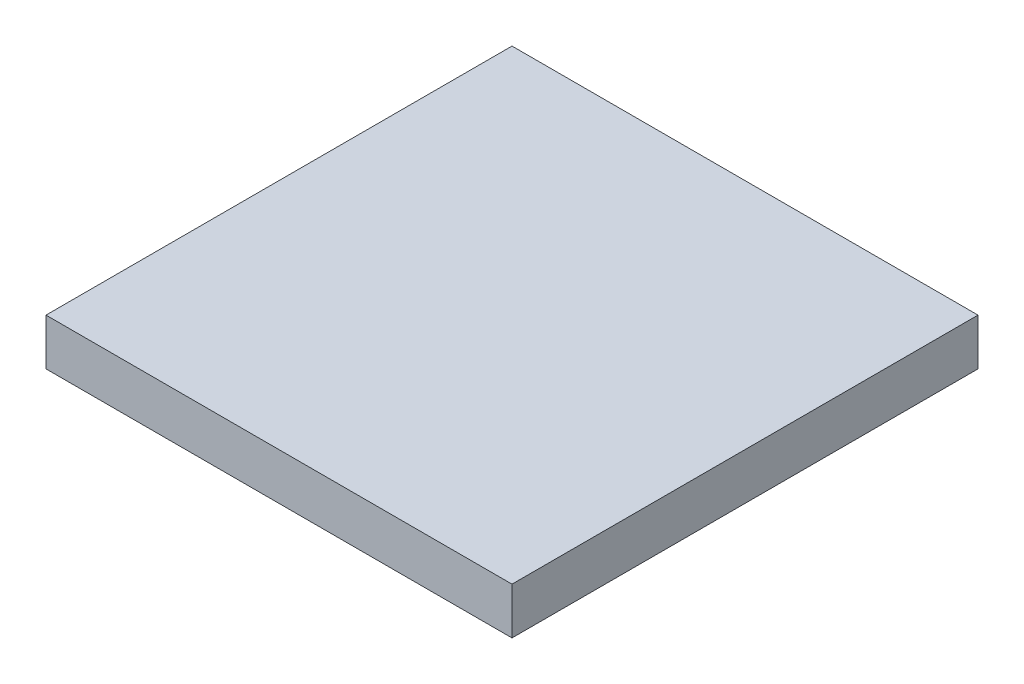
ISO-10303-21;
HEADER;
FILE_DESCRIPTION(('STEP AP214'),'2;1');
FILE_NAME('part.step','',(''),(''),'','','');
FILE_SCHEMA(('AUTOMOTIVE_DESIGN { 1 0 10303 214 1 1 1 1 }'));
ENDSEC;
DATA;
#1=APPLICATION_CONTEXT('core data for automotive mechanical design processes');
#2=APPLICATION_PROTOCOL_DEFINITION('international standard','automotive_design',2000,#1);
#3=PRODUCT_CONTEXT('',#1,'mechanical');
#4=PRODUCT('Part','Part','',(#3));
#5=PRODUCT_RELATED_PRODUCT_CATEGORY('part','',(#4));
#6=PRODUCT_DEFINITION_FORMATION('','',#4);
#7=PRODUCT_DEFINITION_CONTEXT('part definition',#1,'design');
#8=PRODUCT_DEFINITION('design','',#6,#7);
#9=PRODUCT_DEFINITION_SHAPE('','',#8);
#10=(LENGTH_UNIT() NAMED_UNIT(*) SI_UNIT(.MILLI.,.METRE.));
#11=(NAMED_UNIT(*) PLANE_ANGLE_UNIT() SI_UNIT($,.RADIAN.));
#12=(NAMED_UNIT(*) SI_UNIT($,.STERADIAN.) SOLID_ANGLE_UNIT());
#13=UNCERTAINTY_MEASURE_WITH_UNIT(LENGTH_MEASURE(1.E-05),#10,'distance_accuracy_value','');
#14=(GEOMETRIC_REPRESENTATION_CONTEXT(3) GLOBAL_UNCERTAINTY_ASSIGNED_CONTEXT((#13)) GLOBAL_UNIT_ASSIGNED_CONTEXT((#10,
#11,#12)) REPRESENTATION_CONTEXT('',''));
#15=CARTESIAN_POINT('',(0.,0.,0.));
#16=DIRECTION('',(0.,0.,1.));
#17=DIRECTION('',(1.,0.,0.));
#18=AXIS2_PLACEMENT_3D('',#15,#16,#17);
#19=CARTESIAN_POINT('',(150.,30.,150.));
#20=DIRECTION('',(-1.,0.,0.));
#21=DIRECTION('',(0.,0.,1.));
#22=AXIS2_PLACEMENT_3D('',#19,#20,#21);
#23=PLANE('',#22);
#24=DIRECTION('',(0.,0.,-1.));
#25=VECTOR('',#24,1.);
#26=CARTESIAN_POINT('',(150.,0.,150.));
#27=LINE('',#26,#25);
#28=CARTESIAN_POINT('',(150.,0.,150.));
#29=VERTEX_POINT('',#28);
#30=CARTESIAN_POINT('',(150.,0.,-150.));
#31=VERTEX_POINT('',#30);
#32=EDGE_CURVE('E96',#29,#31,#27,.T.);
#33=ORIENTED_EDGE('',*,*,#32,.T.);
#34=DIRECTION('',(0.,-1.,0.));
#35=VECTOR('',#34,1.);
#36=CARTESIAN_POINT('',(150.,30.,-150.));
#37=LINE('',#36,#35);
#38=CARTESIAN_POINT('',(150.,30.,-150.));
#39=VERTEX_POINT('',#38);
#40=EDGE_CURVE('E11',#39,#31,#37,.T.);
#41=ORIENTED_EDGE('',*,*,#40,.F.);
#42=DIRECTION('',(0.,0.,-1.));
#43=VECTOR('',#42,1.);
#44=CARTESIAN_POINT('',(150.,30.,150.));
#45=LINE('',#44,#43);
#46=CARTESIAN_POINT('',(150.,30.,150.));
#47=VERTEX_POINT('',#46);
#48=EDGE_CURVE('E84',#47,#39,#45,.T.);
#49=ORIENTED_EDGE('',*,*,#48,.F.);
#50=DIRECTION('',(0.,-1.,0.));
#51=VECTOR('',#50,1.);
#52=CARTESIAN_POINT('',(150.,30.,150.));
#53=LINE('',#52,#51);
#54=EDGE_CURVE('E92',#47,#29,#53,.T.);
#55=ORIENTED_EDGE('',*,*,#54,.T.);
#56=EDGE_LOOP('',(#33,#41,#49,#55));
#57=FACE_BOUND('',#56,.T.);
#58=ADVANCED_FACE('F33',(#57),#23,.F.);
#59=CARTESIAN_POINT('',(-150.,30.,-150.));
#60=DIRECTION('',(0.,0.,1.));
#61=DIRECTION('',(1.,0.,0.));
#62=AXIS2_PLACEMENT_3D('',#59,#60,#61);
#63=PLANE('',#62);
#64=DIRECTION('',(-1.,0.,0.));
#65=VECTOR('',#64,1.);
#66=CARTESIAN_POINT('',(-150.,0.,-150.));
#67=LINE('',#66,#65);
#68=CARTESIAN_POINT('',(-150.,0.,-150.));
#69=VERTEX_POINT('',#68);
#70=EDGE_CURVE('E88',#31,#69,#67,.T.);
#71=ORIENTED_EDGE('',*,*,#70,.T.);
#72=DIRECTION('',(0.,-1.,0.));
#73=VECTOR('',#72,1.);
#74=CARTESIAN_POINT('',(-150.,30.,-150.));
#75=LINE('',#74,#73);
#76=CARTESIAN_POINT('',(-150.,30.,-150.));
#77=VERTEX_POINT('',#76);
#78=EDGE_CURVE('E41',#77,#69,#75,.T.);
#79=ORIENTED_EDGE('',*,*,#78,.F.);
#80=DIRECTION('',(-1.,0.,0.));
#81=VECTOR('',#80,1.);
#82=CARTESIAN_POINT('',(-150.,30.,-150.));
#83=LINE('',#82,#81);
#84=EDGE_CURVE('E79',#39,#77,#83,.T.);
#85=ORIENTED_EDGE('',*,*,#84,.F.);
#86=ORIENTED_EDGE('',*,*,#40,.T.);
#87=EDGE_LOOP('',(#71,#79,#85,#86));
#88=FACE_BOUND('',#87,.T.);
#89=ADVANCED_FACE('F87',(#88),#63,.F.);
#90=CARTESIAN_POINT('',(-150.,30.,150.));
#91=DIRECTION('',(1.,0.,0.));
#92=DIRECTION('',(0.,0.,-1.));
#93=AXIS2_PLACEMENT_3D('',#90,#91,#92);
#94=PLANE('',#93);
#95=DIRECTION('',(0.,0.,1.));
#96=VECTOR('',#95,1.);
#97=CARTESIAN_POINT('',(-150.,0.,150.));
#98=LINE('',#97,#96);
#99=CARTESIAN_POINT('',(-150.,0.,150.));
#100=VERTEX_POINT('',#99);
#101=EDGE_CURVE('E66',#69,#100,#98,.T.);
#102=ORIENTED_EDGE('',*,*,#101,.T.);
#103=DIRECTION('',(0.,-1.,0.));
#104=VECTOR('',#103,1.);
#105=CARTESIAN_POINT('',(-150.,30.,150.));
#106=LINE('',#105,#104);
#107=CARTESIAN_POINT('',(-150.,30.,150.));
#108=VERTEX_POINT('',#107);
#109=EDGE_CURVE('E89',#108,#100,#106,.T.);
#110=ORIENTED_EDGE('',*,*,#109,.F.);
#111=DIRECTION('',(0.,0.,1.));
#112=VECTOR('',#111,1.);
#113=CARTESIAN_POINT('',(-150.,30.,150.));
#114=LINE('',#113,#112);
#115=EDGE_CURVE('E82',#77,#108,#114,.T.);
#116=ORIENTED_EDGE('',*,*,#115,.F.);
#117=ORIENTED_EDGE('',*,*,#78,.T.);
#118=EDGE_LOOP('',(#102,#110,#116,#117));
#119=FACE_BOUND('',#118,.T.);
#120=ADVANCED_FACE('F90',(#119),#94,.F.);
#121=CARTESIAN_POINT('',(-150.,30.,150.));
#122=DIRECTION('',(0.,0.,-1.));
#123=DIRECTION('',(-1.,0.,0.));
#124=AXIS2_PLACEMENT_3D('',#121,#122,#123);
#125=PLANE('',#124);
#126=DIRECTION('',(1.,0.,0.));
#127=VECTOR('',#126,1.);
#128=CARTESIAN_POINT('',(-150.,0.,150.));
#129=LINE('',#128,#127);
#130=EDGE_CURVE('E72',#100,#29,#129,.T.);
#131=ORIENTED_EDGE('',*,*,#130,.T.);
#132=ORIENTED_EDGE('',*,*,#54,.F.);
#133=DIRECTION('',(1.,0.,0.));
#134=VECTOR('',#133,1.);
#135=CARTESIAN_POINT('',(-150.,30.,150.));
#136=LINE('',#135,#134);
#137=EDGE_CURVE('E49',#108,#47,#136,.T.);
#138=ORIENTED_EDGE('',*,*,#137,.F.);
#139=ORIENTED_EDGE('',*,*,#109,.T.);
#140=EDGE_LOOP('',(#131,#132,#138,#139));
#141=FACE_BOUND('',#140,.T.);
#142=ADVANCED_FACE('F103',(#141),#125,.F.);
#143=CARTESIAN_POINT('',(0.,30.,0.));
#144=DIRECTION('',(0.,-1.,0.));
#145=DIRECTION('',(0.,0.,-1.));
#146=AXIS2_PLACEMENT_3D('',#143,#144,#145);
#147=PLANE('',#146);
#148=ORIENTED_EDGE('',*,*,#48,.T.);
#149=ORIENTED_EDGE('',*,*,#84,.T.);
#150=ORIENTED_EDGE('',*,*,#115,.T.);
#151=ORIENTED_EDGE('',*,*,#137,.T.);
#152=EDGE_LOOP('',(#148,#149,#150,#151));
#153=FACE_BOUND('',#152,.T.);
#154=ADVANCED_FACE('F80',(#153),#147,.F.);
#155=CARTESIAN_POINT('',(0.,0.,0.));
#156=DIRECTION('',(0.,-1.,0.));
#157=DIRECTION('',(0.,0.,-1.));
#158=AXIS2_PLACEMENT_3D('',#155,#156,#157);
#159=PLANE('',#158);
#160=ORIENTED_EDGE('',*,*,#32,.F.);
#161=ORIENTED_EDGE('',*,*,#130,.F.);
#162=ORIENTED_EDGE('',*,*,#101,.F.);
#163=ORIENTED_EDGE('',*,*,#70,.F.);
#164=EDGE_LOOP('',(#160,#161,#162,#163));
#165=FACE_BOUND('',#164,.T.);
#166=ADVANCED_FACE('F106',(#165),#159,.T.);
#167=CLOSED_SHELL('',(#58,#89,#120,#142,#154,#166));
#168=MANIFOLD_SOLID_BREP('B2',#167);
#169=ADVANCED_BREP_SHAPE_REPRESENTATION('',(#18,#168),#14);
#170=SHAPE_DEFINITION_REPRESENTATION(#9,#169);
ENDSEC;
END-ISO-10303-21;
